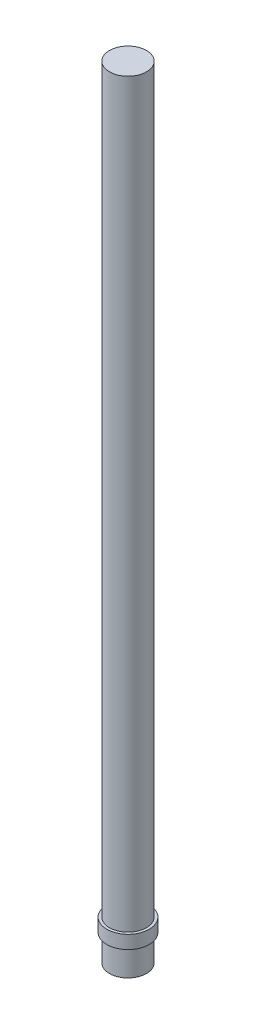
ISO-10303-21;
HEADER;
FILE_DESCRIPTION(('STEP AP214'),'2;1');
FILE_NAME('part.step','',(''),(''),'','','');
FILE_SCHEMA(('AUTOMOTIVE_DESIGN { 1 0 10303 214 1 1 1 1 }'));
ENDSEC;
DATA;
#1=APPLICATION_CONTEXT('core data for automotive mechanical design processes');
#2=APPLICATION_PROTOCOL_DEFINITION('international standard','automotive_design',2000,#1);
#3=PRODUCT_CONTEXT('',#1,'mechanical');
#4=PRODUCT('Part','Part','',(#3));
#5=PRODUCT_RELATED_PRODUCT_CATEGORY('part','',(#4));
#6=PRODUCT_DEFINITION_FORMATION('','',#4);
#7=PRODUCT_DEFINITION_CONTEXT('part definition',#1,'design');
#8=PRODUCT_DEFINITION('design','',#6,#7);
#9=PRODUCT_DEFINITION_SHAPE('','',#8);
#10=(LENGTH_UNIT() NAMED_UNIT(*) SI_UNIT(.MILLI.,.METRE.));
#11=(NAMED_UNIT(*) PLANE_ANGLE_UNIT() SI_UNIT($,.RADIAN.));
#12=(NAMED_UNIT(*) SI_UNIT($,.STERADIAN.) SOLID_ANGLE_UNIT());
#13=UNCERTAINTY_MEASURE_WITH_UNIT(LENGTH_MEASURE(1.E-05),#10,'distance_accuracy_value','');
#14=(GEOMETRIC_REPRESENTATION_CONTEXT(3) GLOBAL_UNCERTAINTY_ASSIGNED_CONTEXT((#13)) GLOBAL_UNIT_ASSIGNED_CONTEXT((#10,
#11,#12)) REPRESENTATION_CONTEXT('',''));
#15=CARTESIAN_POINT('',(0.,0.,0.));
#16=DIRECTION('',(0.,0.,1.));
#17=DIRECTION('',(1.,0.,0.));
#18=AXIS2_PLACEMENT_3D('',#15,#16,#17);
#19=CARTESIAN_POINT('',(0.,5.,0.));
#20=DIRECTION('',(0.,-1.,0.));
#21=DIRECTION('',(0.,0.,-1.));
#22=AXIS2_PLACEMENT_3D('',#19,#20,#21);
#23=CYLINDRICAL_SURFACE('',#22,3.5);
#24=CARTESIAN_POINT('',(0.,5.,0.));
#25=DIRECTION('',(0.,1.,0.));
#26=DIRECTION('',(0.,0.,1.));
#27=AXIS2_PLACEMENT_3D('',#24,#25,#26);
#28=CIRCLE('',#27,3.5);
#29=CARTESIAN_POINT('',(0.,5.,3.5));
#30=VERTEX_POINT('',#29);
#31=EDGE_CURVE('E42',#30,#30,#28,.T.);
#32=ORIENTED_EDGE('',*,*,#31,.F.);
#33=EDGE_LOOP('',(#32));
#34=FACE_BOUND('',#33,.T.);
#35=CARTESIAN_POINT('',(0.,0.,0.));
#36=DIRECTION('',(0.,1.,0.));
#37=DIRECTION('',(0.,0.,1.));
#38=AXIS2_PLACEMENT_3D('',#35,#36,#37);
#39=CIRCLE('',#38,3.5);
#40=CARTESIAN_POINT('',(0.,0.,3.5));
#41=VERTEX_POINT('',#40);
#42=EDGE_CURVE('E38',#41,#41,#39,.T.);
#43=ORIENTED_EDGE('',*,*,#42,.T.);
#44=EDGE_LOOP('',(#43));
#45=FACE_BOUND('',#44,.T.);
#46=ADVANCED_FACE('F35',(#34,#45),#23,.T.);
#47=CARTESIAN_POINT('',(0.,0.,0.));
#48=DIRECTION('',(0.,1.,0.));
#49=DIRECTION('',(0.,0.,1.));
#50=AXIS2_PLACEMENT_3D('',#47,#48,#49);
#51=PLANE('',#50);
#52=ORIENTED_EDGE('',*,*,#42,.F.);
#53=EDGE_LOOP('',(#52));
#54=FACE_BOUND('',#53,.T.);
#55=ADVANCED_FACE('F76',(#54),#51,.F.);
#56=CARTESIAN_POINT('',(0.,7.5,0.));
#57=DIRECTION('',(0.,-1.,0.));
#58=DIRECTION('',(0.,0.,-1.));
#59=AXIS2_PLACEMENT_3D('',#56,#57,#58);
#60=CYLINDRICAL_SURFACE('',#59,4.);
#61=CARTESIAN_POINT('',(0.,7.5,0.));
#62=DIRECTION('',(0.,1.,0.));
#63=DIRECTION('',(0.,0.,1.));
#64=AXIS2_PLACEMENT_3D('',#61,#62,#63);
#65=CIRCLE('',#64,4.);
#66=CARTESIAN_POINT('',(0.,7.5,4.));
#67=VERTEX_POINT('',#66);
#68=EDGE_CURVE('E50',#67,#67,#65,.T.);
#69=ORIENTED_EDGE('',*,*,#68,.F.);
#70=EDGE_LOOP('',(#69));
#71=FACE_BOUND('',#70,.T.);
#72=CARTESIAN_POINT('',(0.,5.,0.));
#73=DIRECTION('',(0.,1.,0.));
#74=DIRECTION('',(0.,0.,1.));
#75=AXIS2_PLACEMENT_3D('',#72,#73,#74);
#76=CIRCLE('',#75,4.);
#77=CARTESIAN_POINT('',(0.,5.,4.));
#78=VERTEX_POINT('',#77);
#79=EDGE_CURVE('E53',#78,#78,#76,.T.);
#80=ORIENTED_EDGE('',*,*,#79,.T.);
#81=EDGE_LOOP('',(#80));
#82=FACE_BOUND('',#81,.T.);
#83=ADVANCED_FACE('F81',(#71,#82),#60,.T.);
#84=CARTESIAN_POINT('',(0.,7.5,0.));
#85=DIRECTION('',(0.,1.,0.));
#86=DIRECTION('',(0.,0.,1.));
#87=AXIS2_PLACEMENT_3D('',#84,#85,#86);
#88=PLANE('',#87);
#89=CARTESIAN_POINT('',(0.,7.5,0.));
#90=DIRECTION('',(0.,1.,0.));
#91=DIRECTION('',(0.,0.,1.));
#92=AXIS2_PLACEMENT_3D('',#89,#90,#91);
#93=CIRCLE('',#92,3.5);
#94=CARTESIAN_POINT('',(0.,7.5,3.5));
#95=VERTEX_POINT('',#94);
#96=EDGE_CURVE('E10',#95,#95,#93,.T.);
#97=ORIENTED_EDGE('',*,*,#96,.F.);
#98=EDGE_LOOP('',(#97));
#99=FACE_BOUND('',#98,.T.);
#100=ORIENTED_EDGE('',*,*,#68,.T.);
#101=EDGE_LOOP('',(#100));
#102=FACE_BOUND('',#101,.T.);
#103=ADVANCED_FACE('F71',(#99,#102),#88,.T.);
#104=CARTESIAN_POINT('',(0.,5.,0.));
#105=DIRECTION('',(0.,1.,0.));
#106=DIRECTION('',(0.,0.,1.));
#107=AXIS2_PLACEMENT_3D('',#104,#105,#106);
#108=PLANE('',#107);
#109=ORIENTED_EDGE('',*,*,#31,.T.);
#110=EDGE_LOOP('',(#109));
#111=FACE_BOUND('',#110,.T.);
#112=ORIENTED_EDGE('',*,*,#79,.F.);
#113=EDGE_LOOP('',(#112));
#114=FACE_BOUND('',#113,.T.);
#115=ADVANCED_FACE('F64',(#111,#114),#108,.F.);
#116=CARTESIAN_POINT('',(0.,147.5,0.));
#117=DIRECTION('',(0.,-1.,0.));
#118=DIRECTION('',(0.,0.,-1.));
#119=AXIS2_PLACEMENT_3D('',#116,#117,#118);
#120=CYLINDRICAL_SURFACE('',#119,3.5);
#121=CARTESIAN_POINT('',(0.,147.5,0.));
#122=DIRECTION('',(0.,1.,0.));
#123=DIRECTION('',(0.,0.,1.));
#124=AXIS2_PLACEMENT_3D('',#121,#122,#123);
#125=CIRCLE('',#124,3.5);
#126=CARTESIAN_POINT('',(0.,147.5,3.5));
#127=VERTEX_POINT('',#126);
#128=EDGE_CURVE('E49',#127,#127,#125,.T.);
#129=ORIENTED_EDGE('',*,*,#128,.F.);
#130=EDGE_LOOP('',(#129));
#131=FACE_BOUND('',#130,.T.);
#132=ORIENTED_EDGE('',*,*,#96,.T.);
#133=EDGE_LOOP('',(#132));
#134=FACE_BOUND('',#133,.T.);
#135=ADVANCED_FACE('F62',(#131,#134),#120,.T.);
#136=CARTESIAN_POINT('',(0.,147.5,0.));
#137=DIRECTION('',(0.,1.,0.));
#138=DIRECTION('',(0.,0.,1.));
#139=AXIS2_PLACEMENT_3D('',#136,#137,#138);
#140=PLANE('',#139);
#141=ORIENTED_EDGE('',*,*,#128,.T.);
#142=EDGE_LOOP('',(#141));
#143=FACE_BOUND('',#142,.T.);
#144=ADVANCED_FACE('F60',(#143),#140,.T.);
#145=CLOSED_SHELL('',(#46,#55,#83,#103,#115,#135,#144));
#146=MANIFOLD_SOLID_BREP('B2',#145);
#147=ADVANCED_BREP_SHAPE_REPRESENTATION('',(#18,#146),#14);
#148=SHAPE_DEFINITION_REPRESENTATION(#9,#147);
ENDSEC;
END-ISO-10303-21;
